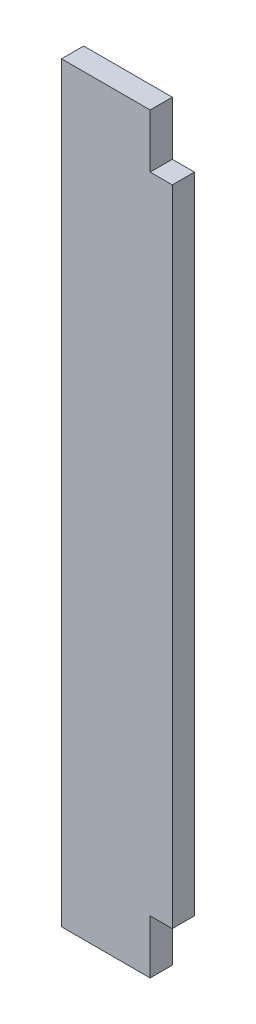
ISO-10303-21;
HEADER;
FILE_DESCRIPTION(('STEP AP214'),'2;1');
FILE_NAME('part.step','',(''),(''),'','','');
FILE_SCHEMA(('AUTOMOTIVE_DESIGN { 1 0 10303 214 1 1 1 1 }'));
ENDSEC;
DATA;
#1=APPLICATION_CONTEXT('core data for automotive mechanical design processes');
#2=APPLICATION_PROTOCOL_DEFINITION('international standard','automotive_design',2000,#1);
#3=PRODUCT_CONTEXT('',#1,'mechanical');
#4=PRODUCT('Part','Part','',(#3));
#5=PRODUCT_RELATED_PRODUCT_CATEGORY('part','',(#4));
#6=PRODUCT_DEFINITION_FORMATION('','',#4);
#7=PRODUCT_DEFINITION_CONTEXT('part definition',#1,'design');
#8=PRODUCT_DEFINITION('design','',#6,#7);
#9=PRODUCT_DEFINITION_SHAPE('','',#8);
#10=(LENGTH_UNIT() NAMED_UNIT(*) SI_UNIT(.MILLI.,.METRE.));
#11=(NAMED_UNIT(*) PLANE_ANGLE_UNIT() SI_UNIT($,.RADIAN.));
#12=(NAMED_UNIT(*) SI_UNIT($,.STERADIAN.) SOLID_ANGLE_UNIT());
#13=UNCERTAINTY_MEASURE_WITH_UNIT(LENGTH_MEASURE(1.E-05),#10,'distance_accuracy_value','');
#14=(GEOMETRIC_REPRESENTATION_CONTEXT(3) GLOBAL_UNCERTAINTY_ASSIGNED_CONTEXT((#13)) GLOBAL_UNIT_ASSIGNED_CONTEXT((#10,
#11,#12)) REPRESENTATION_CONTEXT('',''));
#15=CARTESIAN_POINT('',(0.,0.,0.));
#16=DIRECTION('',(0.,0.,1.));
#17=DIRECTION('',(1.,0.,0.));
#18=AXIS2_PLACEMENT_3D('',#15,#16,#17);
#19=CARTESIAN_POINT('',(11403.5416666658,-5808.6625,-17.78));
#20=DIRECTION('',(-1.,0.,0.));
#21=DIRECTION('',(0.,0.,1.));
#22=AXIS2_PLACEMENT_3D('',#19,#20,#21);
#23=PLANE('',#22);
#24=DIRECTION('',(0.,-1.,0.));
#25=VECTOR('',#24,1.);
#26=CARTESIAN_POINT('',(11403.5416666658,-5808.6625,0.));
#27=LINE('',#26,#25);
#28=CARTESIAN_POINT('',(11403.5416666658,-5808.6625,0.));
#29=VERTEX_POINT('',#28);
#30=CARTESIAN_POINT('',(11403.5416666658,-6411.9125,0.));
#31=VERTEX_POINT('',#30);
#32=EDGE_CURVE('E128',#29,#31,#27,.T.);
#33=ORIENTED_EDGE('',*,*,#32,.F.);
#34=DIRECTION('',(0.,0.,1.));
#35=VECTOR('',#34,1.);
#36=CARTESIAN_POINT('',(11403.5416666658,-5808.6625,-17.78));
#37=LINE('',#36,#35);
#38=CARTESIAN_POINT('',(11403.5416666658,-5808.6625,-17.78));
#39=VERTEX_POINT('',#38);
#40=EDGE_CURVE('E11',#39,#29,#37,.T.);
#41=ORIENTED_EDGE('',*,*,#40,.F.);
#42=DIRECTION('',(0.,-1.,0.));
#43=VECTOR('',#42,1.);
#44=CARTESIAN_POINT('',(11403.5416666658,-5808.6625,-17.78));
#45=LINE('',#44,#43);
#46=CARTESIAN_POINT('',(11403.5416666658,-6411.9125,-17.78));
#47=VERTEX_POINT('',#46);
#48=EDGE_CURVE('E148',#39,#47,#45,.T.);
#49=ORIENTED_EDGE('',*,*,#48,.T.);
#50=DIRECTION('',(0.,0.,1.));
#51=VECTOR('',#50,1.);
#52=CARTESIAN_POINT('',(11403.5416666658,-6411.9125,-17.78));
#53=LINE('',#52,#51);
#54=EDGE_CURVE('E34',#47,#31,#53,.T.);
#55=ORIENTED_EDGE('',*,*,#54,.T.);
#56=EDGE_LOOP('',(#33,#41,#49,#55));
#57=FACE_BOUND('',#56,.T.);
#58=ADVANCED_FACE('F31',(#57),#23,.T.);
#59=CARTESIAN_POINT('',(11474.6616666658,-5808.6625,-17.78));
#60=DIRECTION('',(0.,1.,0.));
#61=DIRECTION('',(0.,0.,1.));
#62=AXIS2_PLACEMENT_3D('',#59,#60,#61);
#63=PLANE('',#62);
#64=DIRECTION('',(-1.,0.,0.));
#65=VECTOR('',#64,1.);
#66=CARTESIAN_POINT('',(11474.6616666658,-5808.6625,0.));
#67=LINE('',#66,#65);
#68=CARTESIAN_POINT('',(11474.6616666658,-5808.6625,0.));
#69=VERTEX_POINT('',#68);
#70=EDGE_CURVE('E146',#69,#29,#67,.T.);
#71=ORIENTED_EDGE('',*,*,#70,.F.);
#72=DIRECTION('',(0.,0.,1.));
#73=VECTOR('',#72,1.);
#74=CARTESIAN_POINT('',(11474.6616666658,-5808.6625,-17.78));
#75=LINE('',#74,#73);
#76=CARTESIAN_POINT('',(11474.6616666658,-5808.6625,-17.78));
#77=VERTEX_POINT('',#76);
#78=EDGE_CURVE('E40',#77,#69,#75,.T.);
#79=ORIENTED_EDGE('',*,*,#78,.F.);
#80=DIRECTION('',(-1.,0.,0.));
#81=VECTOR('',#80,1.);
#82=CARTESIAN_POINT('',(11474.6616666658,-5808.6625,-17.78));
#83=LINE('',#82,#81);
#84=EDGE_CURVE('E118',#77,#39,#83,.T.);
#85=ORIENTED_EDGE('',*,*,#84,.T.);
#86=ORIENTED_EDGE('',*,*,#40,.T.);
#87=EDGE_LOOP('',(#71,#79,#85,#86));
#88=FACE_BOUND('',#87,.T.);
#89=ADVANCED_FACE('F160',(#88),#63,.T.);
#90=CARTESIAN_POINT('',(11474.6616666658,-5851.8425,-17.78));
#91=DIRECTION('',(1.,0.,0.));
#92=DIRECTION('',(0.,0.,-1.));
#93=AXIS2_PLACEMENT_3D('',#90,#91,#92);
#94=PLANE('',#93);
#95=DIRECTION('',(0.,1.,0.));
#96=VECTOR('',#95,1.);
#97=CARTESIAN_POINT('',(11474.6616666658,-5851.8425,0.));
#98=LINE('',#97,#96);
#99=CARTESIAN_POINT('',(11474.6616666658,-5851.8425,0.));
#100=VERTEX_POINT('',#99);
#101=EDGE_CURVE('E105',#100,#69,#98,.T.);
#102=ORIENTED_EDGE('',*,*,#101,.F.);
#103=DIRECTION('',(0.,0.,1.));
#104=VECTOR('',#103,1.);
#105=CARTESIAN_POINT('',(11474.6616666658,-5851.8425,-17.78));
#106=LINE('',#105,#104);
#107=CARTESIAN_POINT('',(11474.6616666658,-5851.8425,-17.78));
#108=VERTEX_POINT('',#107);
#109=EDGE_CURVE('E100',#108,#100,#106,.T.);
#110=ORIENTED_EDGE('',*,*,#109,.F.);
#111=DIRECTION('',(0.,1.,0.));
#112=VECTOR('',#111,1.);
#113=CARTESIAN_POINT('',(11474.6616666658,-5851.8425,-17.78));
#114=LINE('',#113,#112);
#115=EDGE_CURVE('E103',#108,#77,#114,.T.);
#116=ORIENTED_EDGE('',*,*,#115,.T.);
#117=ORIENTED_EDGE('',*,*,#78,.T.);
#118=EDGE_LOOP('',(#102,#110,#116,#117));
#119=FACE_BOUND('',#118,.T.);
#120=ADVANCED_FACE('F102',(#119),#94,.T.);
#121=CARTESIAN_POINT('',(11492.4416666658,-5851.8425,-17.78));
#122=DIRECTION('',(0.,1.,0.));
#123=DIRECTION('',(0.,0.,1.));
#124=AXIS2_PLACEMENT_3D('',#121,#122,#123);
#125=PLANE('',#124);
#126=DIRECTION('',(-1.,0.,0.));
#127=VECTOR('',#126,1.);
#128=CARTESIAN_POINT('',(11492.4416666658,-5851.8425,0.));
#129=LINE('',#128,#127);
#130=CARTESIAN_POINT('',(11492.4416666658,-5851.8425,0.));
#131=VERTEX_POINT('',#130);
#132=EDGE_CURVE('E143',#131,#100,#129,.T.);
#133=ORIENTED_EDGE('',*,*,#132,.F.);
#134=DIRECTION('',(0.,0.,1.));
#135=VECTOR('',#134,1.);
#136=CARTESIAN_POINT('',(11492.4416666658,-5851.8425,-17.78));
#137=LINE('',#136,#135);
#138=CARTESIAN_POINT('',(11492.4416666658,-5851.8425,-17.78));
#139=VERTEX_POINT('',#138);
#140=EDGE_CURVE('E110',#139,#131,#137,.T.);
#141=ORIENTED_EDGE('',*,*,#140,.F.);
#142=DIRECTION('',(-1.,0.,0.));
#143=VECTOR('',#142,1.);
#144=CARTESIAN_POINT('',(11492.4416666658,-5851.8425,-17.78));
#145=LINE('',#144,#143);
#146=EDGE_CURVE('E116',#139,#108,#145,.T.);
#147=ORIENTED_EDGE('',*,*,#146,.T.);
#148=ORIENTED_EDGE('',*,*,#109,.T.);
#149=EDGE_LOOP('',(#133,#141,#147,#148));
#150=FACE_BOUND('',#149,.T.);
#151=ADVANCED_FACE('F120',(#150),#125,.T.);
#152=CARTESIAN_POINT('',(11492.4416666658,-6368.7325,-17.78));
#153=DIRECTION('',(1.,0.,0.));
#154=DIRECTION('',(0.,0.,-1.));
#155=AXIS2_PLACEMENT_3D('',#152,#153,#154);
#156=PLANE('',#155);
#157=DIRECTION('',(0.,1.,0.));
#158=VECTOR('',#157,1.);
#159=CARTESIAN_POINT('',(11492.4416666658,-6368.7325,0.));
#160=LINE('',#159,#158);
#161=CARTESIAN_POINT('',(11492.4416666658,-6368.7325,0.));
#162=VERTEX_POINT('',#161);
#163=EDGE_CURVE('E140',#162,#131,#160,.T.);
#164=ORIENTED_EDGE('',*,*,#163,.F.);
#165=DIRECTION('',(0.,0.,1.));
#166=VECTOR('',#165,1.);
#167=CARTESIAN_POINT('',(11492.4416666658,-6368.7325,-17.78));
#168=LINE('',#167,#166);
#169=CARTESIAN_POINT('',(11492.4416666658,-6368.7325,-17.78));
#170=VERTEX_POINT('',#169);
#171=EDGE_CURVE('E152',#170,#162,#168,.T.);
#172=ORIENTED_EDGE('',*,*,#171,.F.);
#173=DIRECTION('',(0.,1.,0.));
#174=VECTOR('',#173,1.);
#175=CARTESIAN_POINT('',(11492.4416666658,-6368.7325,-17.78));
#176=LINE('',#175,#174);
#177=EDGE_CURVE('E121',#170,#139,#176,.T.);
#178=ORIENTED_EDGE('',*,*,#177,.T.);
#179=ORIENTED_EDGE('',*,*,#140,.T.);
#180=EDGE_LOOP('',(#164,#172,#178,#179));
#181=FACE_BOUND('',#180,.T.);
#182=ADVANCED_FACE('F173',(#181),#156,.T.);
#183=CARTESIAN_POINT('',(11474.6616666658,-6368.7325,-17.78));
#184=DIRECTION('',(0.,-1.,0.));
#185=DIRECTION('',(0.,0.,-1.));
#186=AXIS2_PLACEMENT_3D('',#183,#184,#185);
#187=PLANE('',#186);
#188=DIRECTION('',(1.,0.,0.));
#189=VECTOR('',#188,1.);
#190=CARTESIAN_POINT('',(11474.6616666658,-6368.7325,0.));
#191=LINE('',#190,#189);
#192=CARTESIAN_POINT('',(11474.6616666658,-6368.7325,0.));
#193=VERTEX_POINT('',#192);
#194=EDGE_CURVE('E137',#193,#162,#191,.T.);
#195=ORIENTED_EDGE('',*,*,#194,.F.);
#196=DIRECTION('',(0.,0.,1.));
#197=VECTOR('',#196,1.);
#198=CARTESIAN_POINT('',(11474.6616666658,-6368.7325,-17.78));
#199=LINE('',#198,#197);
#200=CARTESIAN_POINT('',(11474.6616666658,-6368.7325,-17.78));
#201=VERTEX_POINT('',#200);
#202=EDGE_CURVE('E154',#201,#193,#199,.T.);
#203=ORIENTED_EDGE('',*,*,#202,.F.);
#204=DIRECTION('',(1.,0.,0.));
#205=VECTOR('',#204,1.);
#206=CARTESIAN_POINT('',(11474.6616666658,-6368.7325,-17.78));
#207=LINE('',#206,#205);
#208=EDGE_CURVE('E123',#201,#170,#207,.T.);
#209=ORIENTED_EDGE('',*,*,#208,.T.);
#210=ORIENTED_EDGE('',*,*,#171,.T.);
#211=EDGE_LOOP('',(#195,#203,#209,#210));
#212=FACE_BOUND('',#211,.T.);
#213=ADVANCED_FACE('F176',(#212),#187,.T.);
#214=CARTESIAN_POINT('',(11474.6616666658,-6411.9125,-17.78));
#215=DIRECTION('',(1.,0.,0.));
#216=DIRECTION('',(0.,0.,-1.));
#217=AXIS2_PLACEMENT_3D('',#214,#215,#216);
#218=PLANE('',#217);
#219=DIRECTION('',(0.,1.,0.));
#220=VECTOR('',#219,1.);
#221=CARTESIAN_POINT('',(11474.6616666658,-6411.9125,0.));
#222=LINE('',#221,#220);
#223=CARTESIAN_POINT('',(11474.6616666658,-6411.9125,0.));
#224=VERTEX_POINT('',#223);
#225=EDGE_CURVE('E134',#224,#193,#222,.T.);
#226=ORIENTED_EDGE('',*,*,#225,.F.);
#227=DIRECTION('',(0.,0.,1.));
#228=VECTOR('',#227,1.);
#229=CARTESIAN_POINT('',(11474.6616666658,-6411.9125,-17.78));
#230=LINE('',#229,#228);
#231=CARTESIAN_POINT('',(11474.6616666658,-6411.9125,-17.78));
#232=VERTEX_POINT('',#231);
#233=EDGE_CURVE('E155',#232,#224,#230,.T.);
#234=ORIENTED_EDGE('',*,*,#233,.F.);
#235=DIRECTION('',(0.,1.,0.));
#236=VECTOR('',#235,1.);
#237=CARTESIAN_POINT('',(11474.6616666658,-6411.9125,-17.78));
#238=LINE('',#237,#236);
#239=EDGE_CURVE('E251',#232,#201,#238,.T.);
#240=ORIENTED_EDGE('',*,*,#239,.T.);
#241=ORIENTED_EDGE('',*,*,#202,.T.);
#242=EDGE_LOOP('',(#226,#234,#240,#241));
#243=FACE_BOUND('',#242,.T.);
#244=ADVANCED_FACE('F180',(#243),#218,.T.);
#245=CARTESIAN_POINT('',(11403.5416666658,-6411.9125,-17.78));
#246=DIRECTION('',(0.,-1.,0.));
#247=DIRECTION('',(0.,0.,-1.));
#248=AXIS2_PLACEMENT_3D('',#245,#246,#247);
#249=PLANE('',#248);
#250=DIRECTION('',(1.,0.,0.));
#251=VECTOR('',#250,1.);
#252=CARTESIAN_POINT('',(11403.5416666658,-6411.9125,0.));
#253=LINE('',#252,#251);
#254=EDGE_CURVE('E131',#31,#224,#253,.T.);
#255=ORIENTED_EDGE('',*,*,#254,.F.);
#256=ORIENTED_EDGE('',*,*,#54,.F.);
#257=DIRECTION('',(1.,0.,0.));
#258=VECTOR('',#257,1.);
#259=CARTESIAN_POINT('',(11403.5416666658,-6411.9125,-17.78));
#260=LINE('',#259,#258);
#261=EDGE_CURVE('E252',#47,#232,#260,.T.);
#262=ORIENTED_EDGE('',*,*,#261,.T.);
#263=ORIENTED_EDGE('',*,*,#233,.T.);
#264=EDGE_LOOP('',(#255,#256,#262,#263));
#265=FACE_BOUND('',#264,.T.);
#266=ADVANCED_FACE('F157',(#265),#249,.T.);
#267=CARTESIAN_POINT('',(11403.5416666658,-6411.9125,-17.78));
#268=DIRECTION('',(0.,0.,1.));
#269=DIRECTION('',(1.,0.,0.));
#270=AXIS2_PLACEMENT_3D('',#267,#268,#269);
#271=PLANE('',#270);
#272=ORIENTED_EDGE('',*,*,#48,.F.);
#273=ORIENTED_EDGE('',*,*,#84,.F.);
#274=ORIENTED_EDGE('',*,*,#115,.F.);
#275=ORIENTED_EDGE('',*,*,#146,.F.);
#276=ORIENTED_EDGE('',*,*,#177,.F.);
#277=ORIENTED_EDGE('',*,*,#208,.F.);
#278=ORIENTED_EDGE('',*,*,#239,.F.);
#279=ORIENTED_EDGE('',*,*,#261,.F.);
#280=EDGE_LOOP('',(#272,#273,#274,#275,#276,#277,#278,#279));
#281=FACE_BOUND('',#280,.T.);
#282=ADVANCED_FACE('F114',(#281),#271,.F.);
#283=CARTESIAN_POINT('',(11403.5416666658,-6411.9125,0.));
#284=DIRECTION('',(0.,0.,1.));
#285=DIRECTION('',(1.,0.,0.));
#286=AXIS2_PLACEMENT_3D('',#283,#284,#285);
#287=PLANE('',#286);
#288=ORIENTED_EDGE('',*,*,#32,.T.);
#289=ORIENTED_EDGE('',*,*,#254,.T.);
#290=ORIENTED_EDGE('',*,*,#225,.T.);
#291=ORIENTED_EDGE('',*,*,#194,.T.);
#292=ORIENTED_EDGE('',*,*,#163,.T.);
#293=ORIENTED_EDGE('',*,*,#132,.T.);
#294=ORIENTED_EDGE('',*,*,#101,.T.);
#295=ORIENTED_EDGE('',*,*,#70,.T.);
#296=EDGE_LOOP('',(#288,#289,#290,#291,#292,#293,#294,#295));
#297=FACE_BOUND('',#296,.T.);
#298=ADVANCED_FACE('F159',(#297),#287,.T.);
#299=CLOSED_SHELL('',(#58,#89,#120,#151,#182,#213,#244,#266,#282,#298));
#300=MANIFOLD_SOLID_BREP('B2',#299);
#301=ADVANCED_BREP_SHAPE_REPRESENTATION('',(#18,#300),#14);
#302=SHAPE_DEFINITION_REPRESENTATION(#9,#301);
ENDSEC;
END-ISO-10303-21;
